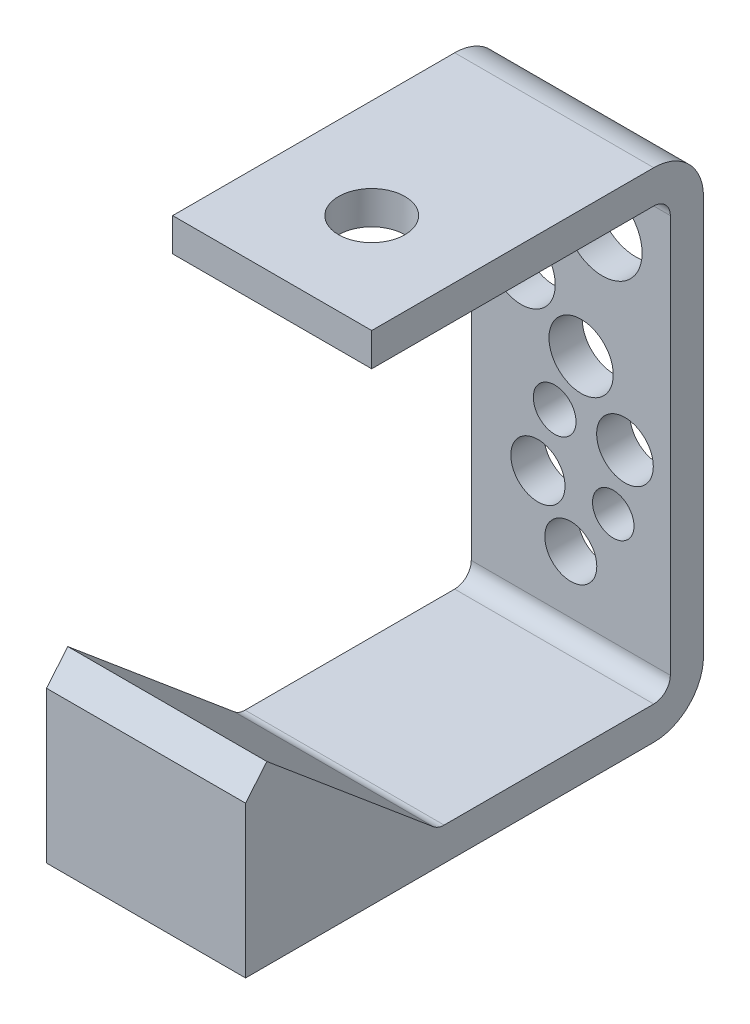
ISO-10303-21;
HEADER;
FILE_DESCRIPTION(('STEP AP214'),'2;1');
FILE_NAME('part.step','',(''),(''),'','','');
FILE_SCHEMA(('AUTOMOTIVE_DESIGN { 1 0 10303 214 1 1 1 1 }'));
ENDSEC;
DATA;
#1=APPLICATION_CONTEXT('core data for automotive mechanical design processes');
#2=APPLICATION_PROTOCOL_DEFINITION('international standard','automotive_design',2000,#1);
#3=PRODUCT_CONTEXT('',#1,'mechanical');
#4=PRODUCT('Part','Part','',(#3));
#5=PRODUCT_RELATED_PRODUCT_CATEGORY('part','',(#4));
#6=PRODUCT_DEFINITION_FORMATION('','',#4);
#7=PRODUCT_DEFINITION_CONTEXT('part definition',#1,'design');
#8=PRODUCT_DEFINITION('design','',#6,#7);
#9=PRODUCT_DEFINITION_SHAPE('','',#8);
#10=(LENGTH_UNIT() NAMED_UNIT(*) SI_UNIT(.MILLI.,.METRE.));
#11=(NAMED_UNIT(*) PLANE_ANGLE_UNIT() SI_UNIT($,.RADIAN.));
#12=(NAMED_UNIT(*) SI_UNIT($,.STERADIAN.) SOLID_ANGLE_UNIT());
#13=UNCERTAINTY_MEASURE_WITH_UNIT(LENGTH_MEASURE(1.E-05),#10,'distance_accuracy_value','');
#14=(GEOMETRIC_REPRESENTATION_CONTEXT(3) GLOBAL_UNCERTAINTY_ASSIGNED_CONTEXT((#13)) GLOBAL_UNIT_ASSIGNED_CONTEXT((#10,
#11,#12)) REPRESENTATION_CONTEXT('',''));
#15=CARTESIAN_POINT('',(0.,0.,0.));
#16=DIRECTION('',(0.,0.,1.));
#17=DIRECTION('',(1.,0.,0.));
#18=AXIS2_PLACEMENT_3D('',#15,#16,#17);
#19=CARTESIAN_POINT('',(19.05,88.9000000000004,3.17499999999983));
#20=DIRECTION('',(0.,-1.00000000000001,0.));
#21=DIRECTION('',(0.,0.,-1.00000000000001));
#22=AXIS2_PLACEMENT_3D('',#19,#20,#21);
#23=PLANE('',#22);
#24=CARTESIAN_POINT('',(0.,88.9000000000004,38.1000000000001));
#25=DIRECTION('',(0.,1.00000000000001,0.));
#26=DIRECTION('',(0.,0.,1.00000000000001));
#27=AXIS2_PLACEMENT_3D('',#24,#25,#26);
#28=CIRCLE('',#27,6.35);
#29=CARTESIAN_POINT('',(0.,88.9000000000004,44.4500000000002));
#30=VERTEX_POINT('',#29);
#31=EDGE_CURVE('E176',#30,#30,#28,.T.);
#32=ORIENTED_EDGE('',*,*,#31,.F.);
#33=EDGE_LOOP('',(#32));
#34=FACE_BOUND('',#33,.T.);
#35=DIRECTION('',(0.,0.,1.00000000000001));
#36=VECTOR('',#35,1.);
#37=CARTESIAN_POINT('',(-19.0500000000001,88.9000000000005,3.17499999999971));
#38=LINE('',#37,#36);
#39=CARTESIAN_POINT('',(-19.0500000000001,88.9000000000005,3.17499999999971));
#40=VERTEX_POINT('',#39);
#41=CARTESIAN_POINT('',(-19.05,88.9,57.15));
#42=VERTEX_POINT('',#41);
#43=EDGE_CURVE('E172',#40,#42,#38,.T.);
#44=ORIENTED_EDGE('',*,*,#43,.T.);
#45=DIRECTION('',(-1.,0.,0.));
#46=VECTOR('',#45,1.);
#47=CARTESIAN_POINT('',(19.0500000000001,88.9000000000005,57.1500000000003));
#48=LINE('',#47,#46);
#49=CARTESIAN_POINT('',(19.0500000000001,88.9000000000005,57.1500000000003));
#50=VERTEX_POINT('',#49);
#51=EDGE_CURVE('E11',#50,#42,#48,.T.);
#52=ORIENTED_EDGE('',*,*,#51,.F.);
#53=DIRECTION('',(0.,0.,1.00000000000001));
#54=VECTOR('',#53,1.);
#55=CARTESIAN_POINT('',(19.05,88.9000000000004,3.17499999999983));
#56=LINE('',#55,#54);
#57=CARTESIAN_POINT('',(19.05,88.9000000000004,3.17499999999983));
#58=VERTEX_POINT('',#57);
#59=EDGE_CURVE('E112',#58,#50,#56,.T.);
#60=ORIENTED_EDGE('',*,*,#59,.F.);
#61=DIRECTION('',(-1.,0.,0.));
#62=VECTOR('',#61,1.);
#63=CARTESIAN_POINT('',(19.05,88.9000000000004,3.17499999999983));
#64=LINE('',#63,#62);
#65=EDGE_CURVE('E168',#58,#40,#64,.T.);
#66=ORIENTED_EDGE('',*,*,#65,.T.);
#67=EDGE_LOOP('',(#44,#52,#60,#66));
#68=FACE_BOUND('',#67,.T.);
#69=ADVANCED_FACE('F37',(#34,#68),#23,.F.);
#70=CARTESIAN_POINT('',(19.0500000000001,82.5500000000004,57.1500000000003));
#71=DIRECTION('',(0.,0.,1.00000000000001));
#72=DIRECTION('',(1.,0.,0.));
#73=AXIS2_PLACEMENT_3D('',#70,#71,#72);
#74=PLANE('',#73);
#75=DIRECTION('',(0.,1.00000000000001,0.));
#76=VECTOR('',#75,1.);
#77=CARTESIAN_POINT('',(-19.05,82.5500000000005,57.1500000000003));
#78=LINE('',#77,#76);
#79=CARTESIAN_POINT('',(-19.05,82.5500000000005,57.1500000000003));
#80=VERTEX_POINT('',#79);
#81=EDGE_CURVE('E175',#80,#42,#78,.T.);
#82=ORIENTED_EDGE('',*,*,#81,.F.);
#83=DIRECTION('',(-1.,0.,0.));
#84=VECTOR('',#83,1.);
#85=CARTESIAN_POINT('',(19.0500000000001,82.5500000000004,57.1500000000003));
#86=LINE('',#85,#84);
#87=CARTESIAN_POINT('',(19.0500000000001,82.5500000000004,57.1500000000003));
#88=VERTEX_POINT('',#87);
#89=EDGE_CURVE('E45',#88,#80,#86,.T.);
#90=ORIENTED_EDGE('',*,*,#89,.F.);
#91=DIRECTION('',(0.,1.00000000000001,0.));
#92=VECTOR('',#91,1.);
#93=CARTESIAN_POINT('',(19.0500000000001,82.5500000000004,57.1500000000003));
#94=LINE('',#93,#92);
#95=EDGE_CURVE('E250',#88,#50,#94,.T.);
#96=ORIENTED_EDGE('',*,*,#95,.T.);
#97=ORIENTED_EDGE('',*,*,#51,.T.);
#98=EDGE_LOOP('',(#82,#90,#96,#97));
#99=FACE_BOUND('',#98,.T.);
#100=ADVANCED_FACE('F236',(#99),#74,.T.);
#101=CARTESIAN_POINT('',(19.0499999999999,82.5500000000002,3.17499999999989));
#102=DIRECTION('',(0.,-1.00000000000001,0.));
#103=DIRECTION('',(0.,0.,-1.00000000000001));
#104=AXIS2_PLACEMENT_3D('',#101,#102,#103);
#105=PLANE('',#104);
#106=CARTESIAN_POINT('',(0.,82.5500000000005,38.1000000000002));
#107=DIRECTION('',(0.,-1.00000000000001,0.));
#108=DIRECTION('',(0.,0.,-1.00000000000001));
#109=AXIS2_PLACEMENT_3D('',#106,#107,#108);
#110=CIRCLE('',#109,6.35);
#111=CARTESIAN_POINT('',(0.,82.5500000000005,31.7500000000002));
#112=VERTEX_POINT('',#111);
#113=EDGE_CURVE('E287',#112,#112,#110,.F.);
#114=ORIENTED_EDGE('',*,*,#113,.T.);
#115=EDGE_LOOP('',(#114));
#116=FACE_BOUND('',#115,.T.);
#117=DIRECTION('',(0.,0.,1.00000000000001));
#118=VECTOR('',#117,1.);
#119=CARTESIAN_POINT('',(-19.0500000000001,82.5500000000004,3.17499999999973));
#120=LINE('',#119,#118);
#121=CARTESIAN_POINT('',(-19.0500000000001,82.5500000000004,3.17499999999973));
#122=VERTEX_POINT('',#121);
#123=EDGE_CURVE('E179',#122,#80,#120,.T.);
#124=ORIENTED_EDGE('',*,*,#123,.F.);
#125=DIRECTION('',(-1.,0.,0.));
#126=VECTOR('',#125,1.);
#127=CARTESIAN_POINT('',(19.0499999999999,82.5500000000002,3.17499999999989));
#128=LINE('',#127,#126);
#129=CARTESIAN_POINT('',(19.0499999999999,82.5500000000002,3.17499999999989));
#130=VERTEX_POINT('',#129);
#131=EDGE_CURVE('E226',#130,#122,#128,.T.);
#132=ORIENTED_EDGE('',*,*,#131,.F.);
#133=DIRECTION('',(0.,0.,1.00000000000001));
#134=VECTOR('',#133,1.);
#135=CARTESIAN_POINT('',(19.0499999999999,82.5500000000002,3.17499999999989));
#136=LINE('',#135,#134);
#137=EDGE_CURVE('E233',#130,#88,#136,.T.);
#138=ORIENTED_EDGE('',*,*,#137,.T.);
#139=ORIENTED_EDGE('',*,*,#89,.T.);
#140=EDGE_LOOP('',(#124,#132,#138,#139));
#141=FACE_BOUND('',#140,.T.);
#142=ADVANCED_FACE('F231',(#116,#141),#105,.T.);
#143=CARTESIAN_POINT('',(19.05,79.3750000000003,3.17499999999979));
#144=DIRECTION('',(-1.,0.,0.));
#145=DIRECTION('',(0.,0.,1.00000000000001));
#146=AXIS2_PLACEMENT_3D('',#143,#144,#145);
#147=CYLINDRICAL_SURFACE('',#146,3.175);
#148=CARTESIAN_POINT('',(-19.0500000000001,79.3750000000004,3.17499999999968));
#149=DIRECTION('',(1.,0.,0.));
#150=DIRECTION('',(0.,0.,-1.00000000000001));
#151=AXIS2_PLACEMENT_3D('',#148,#149,#150);
#152=CIRCLE('',#151,3.175);
#153=CARTESIAN_POINT('',(-19.0500000000001,79.3750000000004,-2.91433543964104E-13));
#154=VERTEX_POINT('',#153);
#155=EDGE_CURVE('E182',#154,#122,#152,.T.);
#156=ORIENTED_EDGE('',*,*,#155,.F.);
#157=DIRECTION('',(-1.,0.,0.));
#158=VECTOR('',#157,1.);
#159=CARTESIAN_POINT('',(19.0499999999999,79.3750000000003,-2.08166817117217E-13));
#160=LINE('',#159,#158);
#161=CARTESIAN_POINT('',(19.0499999999999,79.3750000000003,-2.08166817117217E-13));
#162=VERTEX_POINT('',#161);
#163=EDGE_CURVE('E224',#162,#154,#160,.T.);
#164=ORIENTED_EDGE('',*,*,#163,.F.);
#165=CARTESIAN_POINT('',(19.05,79.3750000000003,3.17499999999979));
#166=DIRECTION('',(1.,0.,0.));
#167=DIRECTION('',(0.,0.,-1.00000000000001));
#168=AXIS2_PLACEMENT_3D('',#165,#166,#167);
#169=CIRCLE('',#168,3.175);
#170=EDGE_CURVE('E247',#162,#130,#169,.T.);
#171=ORIENTED_EDGE('',*,*,#170,.T.);
#172=ORIENTED_EDGE('',*,*,#131,.T.);
#173=EDGE_LOOP('',(#156,#164,#171,#172));
#174=FACE_BOUND('',#173,.T.);
#175=ADVANCED_FACE('F244',(#174),#147,.F.);
#176=CARTESIAN_POINT('',(19.05,3.175,0.));
#177=DIRECTION('',(0.,0.,1.00000000000001));
#178=DIRECTION('',(1.,0.,0.));
#179=AXIS2_PLACEMENT_3D('',#176,#177,#178);
#180=PLANE('',#179);
#181=CARTESIAN_POINT('',(10.3690662992588,36.1521874831047,0.));
#182=DIRECTION('',(0.,0.,1.00000000000001));
#183=DIRECTION('',(1.,0.,0.));
#184=AXIS2_PLACEMENT_3D('',#181,#182,#183);
#185=CIRCLE('',#184,5.42299269951171);
#186=CARTESIAN_POINT('',(15.7920589987705,36.1521874831047,0.));
#187=VERTEX_POINT('',#186);
#188=EDGE_CURVE('E351',#187,#187,#185,.F.);
#189=ORIENTED_EDGE('',*,*,#188,.T.);
#190=EDGE_LOOP('',(#189));
#191=FACE_BOUND('',#190,.T.);
#192=CARTESIAN_POINT('',(0.,14.1796422299133,0.));
#193=DIRECTION('',(0.,0.,1.00000000000001));
#194=DIRECTION('',(1.,0.,0.));
#195=AXIS2_PLACEMENT_3D('',#192,#193,#194);
#196=CIRCLE('',#195,4.97607649487025);
#197=CARTESIAN_POINT('',(4.97607649487025,14.1796422299133,0.));
#198=VERTEX_POINT('',#197);
#199=EDGE_CURVE('E347',#198,#198,#196,.F.);
#200=ORIENTED_EDGE('',*,*,#199,.T.);
#201=EDGE_LOOP('',(#200));
#202=FACE_BOUND('',#201,.T.);
#203=CARTESIAN_POINT('',(-6.29550453883584,24.4252672637048,0.));
#204=DIRECTION('',(0.,0.,1.00000000000001));
#205=DIRECTION('',(1.,0.,0.));
#206=AXIS2_PLACEMENT_3D('',#203,#204,#205);
#207=CIRCLE('',#206,5.18600248029509);
#208=CARTESIAN_POINT('',(-1.10950205854076,24.4252672637048,0.));
#209=VERTEX_POINT('',#208);
#210=EDGE_CURVE('E341',#209,#209,#207,.F.);
#211=ORIENTED_EDGE('',*,*,#210,.T.);
#212=EDGE_LOOP('',(#211));
#213=FACE_BOUND('',#212,.T.);
#214=CARTESIAN_POINT('',(8.12486395345894,24.4252672637048,0.));
#215=DIRECTION('',(0.,0.,1.00000000000001));
#216=DIRECTION('',(1.,0.,0.));
#217=AXIS2_PLACEMENT_3D('',#214,#215,#216);
#218=CIRCLE('',#217,3.96599232547309);
#219=CARTESIAN_POINT('',(12.090856278932,24.4252672637048,0.));
#220=VERTEX_POINT('',#219);
#221=EDGE_CURVE('E335',#220,#220,#218,.F.);
#222=ORIENTED_EDGE('',*,*,#221,.T.);
#223=EDGE_LOOP('',(#222));
#224=FACE_BOUND('',#223,.T.);
#225=CARTESIAN_POINT('',(-3.08603163668428,36.1521874831047,0.));
#226=DIRECTION('',(0.,0.,1.00000000000001));
#227=DIRECTION('',(1.,0.,0.));
#228=AXIS2_PLACEMENT_3D('',#225,#226,#227);
#229=CIRCLE('',#228,4.08663304422149);
#230=CARTESIAN_POINT('',(1.00060140753721,36.1521874831047,0.));
#231=VERTEX_POINT('',#230);
#232=EDGE_CURVE('E327',#231,#231,#229,.F.);
#233=ORIENTED_EDGE('',*,*,#232,.T.);
#234=EDGE_LOOP('',(#233));
#235=FACE_BOUND('',#234,.T.);
#236=CARTESIAN_POINT('',(-9.50497744098741,56.8903200816225,0.));
#237=DIRECTION('',(0.,0.,1.00000000000001));
#238=DIRECTION('',(1.,0.,0.));
#239=AXIS2_PLACEMENT_3D('',#236,#237,#238);
#240=CIRCLE('',#239,6.52839763023499);
#241=CARTESIAN_POINT('',(-2.97657981075242,56.8903200816225,0.));
#242=VERTEX_POINT('',#241);
#243=EDGE_CURVE('E321',#242,#242,#240,.F.);
#244=ORIENTED_EDGE('',*,*,#243,.T.);
#245=EDGE_LOOP('',(#244));
#246=FACE_BOUND('',#245,.T.);
#247=CARTESIAN_POINT('',(1.97506024747779,47.5087839061026,0.));
#248=DIRECTION('',(0.,0.,1.00000000000001));
#249=DIRECTION('',(1.,0.,0.));
#250=AXIS2_PLACEMENT_3D('',#247,#248,#249);
#251=CIRCLE('',#250,6.14980370598115);
#252=CARTESIAN_POINT('',(8.12486395345894,47.5087839061026,0.));
#253=VERTEX_POINT('',#252);
#254=EDGE_CURVE('E315',#253,#253,#251,.F.);
#255=ORIENTED_EDGE('',*,*,#254,.T.);
#256=EDGE_LOOP('',(#255));
#257=FACE_BOUND('',#256,.T.);
#258=CARTESIAN_POINT('',(6.04862200790092,70.4688592830329,0.));
#259=DIRECTION('',(0.,0.,1.00000000000001));
#260=DIRECTION('',(1.,0.,0.));
#261=AXIS2_PLACEMENT_3D('',#258,#259,#260);
#262=CIRCLE('',#261,7.60241873712323);
#263=CARTESIAN_POINT('',(13.6510407450241,70.4688592830329,0.));
#264=VERTEX_POINT('',#263);
#265=EDGE_CURVE('E308',#264,#264,#262,.F.);
#266=ORIENTED_EDGE('',*,*,#265,.T.);
#267=EDGE_LOOP('',(#266));
#268=FACE_BOUND('',#267,.T.);
#269=DIRECTION('',(0.,1.00000000000001,0.));
#270=VECTOR('',#269,1.);
#271=CARTESIAN_POINT('',(-19.05,3.17500000000002,0.));
#272=LINE('',#271,#270);
#273=CARTESIAN_POINT('',(-19.05,3.17500000000002,0.));
#274=VERTEX_POINT('',#273);
#275=EDGE_CURVE('E185',#274,#154,#272,.T.);
#276=ORIENTED_EDGE('',*,*,#275,.F.);
#277=DIRECTION('',(-1.,0.,0.));
#278=VECTOR('',#277,1.);
#279=CARTESIAN_POINT('',(19.05,3.175,0.));
#280=LINE('',#279,#278);
#281=CARTESIAN_POINT('',(19.05,3.175,0.));
#282=VERTEX_POINT('',#281);
#283=EDGE_CURVE('E222',#282,#274,#280,.T.);
#284=ORIENTED_EDGE('',*,*,#283,.F.);
#285=DIRECTION('',(0.,1.00000000000001,0.));
#286=VECTOR('',#285,1.);
#287=CARTESIAN_POINT('',(19.05,3.175,0.));
#288=LINE('',#287,#286);
#289=EDGE_CURVE('E252',#282,#162,#288,.T.);
#290=ORIENTED_EDGE('',*,*,#289,.T.);
#291=ORIENTED_EDGE('',*,*,#163,.T.);
#292=EDGE_LOOP('',(#276,#284,#290,#291));
#293=FACE_BOUND('',#292,.T.);
#294=ADVANCED_FACE('F426',(#191,#202,#213,#224,#235,#246,#257,#268,#293),#180,.T.);
#295=CARTESIAN_POINT('',(19.05,3.17499999999997,3.17499999999997));
#296=DIRECTION('',(-1.,0.,0.));
#297=DIRECTION('',(0.,0.,1.00000000000001));
#298=AXIS2_PLACEMENT_3D('',#295,#296,#297);
#299=CYLINDRICAL_SURFACE('',#298,3.175);
#300=CARTESIAN_POINT('',(-19.05,3.17499999999999,3.175));
#301=DIRECTION('',(1.,0.,0.));
#302=DIRECTION('',(0.,0.,1.00000000000001));
#303=AXIS2_PLACEMENT_3D('',#300,#301,#302);
#304=CIRCLE('',#303,3.175);
#305=CARTESIAN_POINT('',(-19.05,0.,3.17499999999998));
#306=VERTEX_POINT('',#305);
#307=EDGE_CURVE('E188',#306,#274,#304,.T.);
#308=ORIENTED_EDGE('',*,*,#307,.F.);
#309=DIRECTION('',(-1.,0.,0.));
#310=VECTOR('',#309,1.);
#311=CARTESIAN_POINT('',(19.05,0.,3.17499999999998));
#312=LINE('',#311,#310);
#313=CARTESIAN_POINT('',(19.05,0.,3.17499999999998));
#314=VERTEX_POINT('',#313);
#315=EDGE_CURVE('E220',#314,#306,#312,.T.);
#316=ORIENTED_EDGE('',*,*,#315,.F.);
#317=CARTESIAN_POINT('',(19.05,3.17499999999997,3.17499999999997));
#318=DIRECTION('',(1.,0.,0.));
#319=DIRECTION('',(0.,0.,1.00000000000001));
#320=AXIS2_PLACEMENT_3D('',#317,#318,#319);
#321=CIRCLE('',#320,3.175);
#322=EDGE_CURVE('E258',#314,#282,#321,.T.);
#323=ORIENTED_EDGE('',*,*,#322,.T.);
#324=ORIENTED_EDGE('',*,*,#283,.T.);
#325=EDGE_LOOP('',(#308,#316,#323,#324));
#326=FACE_BOUND('',#325,.T.);
#327=ADVANCED_FACE('F422',(#326),#299,.F.);
#328=CARTESIAN_POINT('',(19.0500000000001,0.,43.2943945062051));
#329=DIRECTION('',(0.,1.00000000000001,0.));
#330=DIRECTION('',(0.,0.,1.00000000000001));
#331=AXIS2_PLACEMENT_3D('',#328,#329,#330);
#332=PLANE('',#331);
#333=DIRECTION('',(0.,0.,-1.00000000000001));
#334=VECTOR('',#333,1.);
#335=CARTESIAN_POINT('',(-19.0499999999999,0.,43.294394506205));
#336=LINE('',#335,#334);
#337=CARTESIAN_POINT('',(-19.0499999999999,0.,43.294394506205));
#338=VERTEX_POINT('',#337);
#339=EDGE_CURVE('E191',#338,#306,#336,.T.);
#340=ORIENTED_EDGE('',*,*,#339,.F.);
#341=DIRECTION('',(-1.,0.,0.));
#342=VECTOR('',#341,1.);
#343=CARTESIAN_POINT('',(19.0500000000001,0.,43.2943945062051));
#344=LINE('',#343,#342);
#345=CARTESIAN_POINT('',(19.0500000000001,0.,43.2943945062051));
#346=VERTEX_POINT('',#345);
#347=EDGE_CURVE('E218',#346,#338,#344,.T.);
#348=ORIENTED_EDGE('',*,*,#347,.F.);
#349=DIRECTION('',(0.,0.,-1.00000000000001));
#350=VECTOR('',#349,1.);
#351=CARTESIAN_POINT('',(19.0500000000001,0.,43.2943945062051));
#352=LINE('',#351,#350);
#353=EDGE_CURVE('E261',#346,#314,#352,.T.);
#354=ORIENTED_EDGE('',*,*,#353,.T.);
#355=ORIENTED_EDGE('',*,*,#315,.T.);
#356=EDGE_LOOP('',(#340,#348,#354,#355));
#357=FACE_BOUND('',#356,.T.);
#358=ADVANCED_FACE('F418',(#357),#332,.T.);
#359=CARTESIAN_POINT('',(19.0500000000001,3.17499999999996,43.2943945062051));
#360=DIRECTION('',(-1.,0.,0.));
#361=DIRECTION('',(0.,0.,1.00000000000001));
#362=AXIS2_PLACEMENT_3D('',#359,#360,#361);
#363=CYLINDRICAL_SURFACE('',#362,3.175);
#364=CARTESIAN_POINT('',(-19.0499999999999,3.17499999999997,43.294394506205));
#365=DIRECTION('',(1.,0.,0.));
#366=DIRECTION('',(0.,0.,-1.00000000000001));
#367=AXIS2_PLACEMENT_3D('',#364,#365,#366);
#368=CIRCLE('',#367,3.175);
#369=CARTESIAN_POINT('',(-19.0499999999999,0.742808893097198,45.3352451669598));
#370=VERTEX_POINT('',#369);
#371=EDGE_CURVE('E194',#370,#338,#368,.T.);
#372=ORIENTED_EDGE('',*,*,#371,.F.);
#373=DIRECTION('',(-1.,0.,0.));
#374=VECTOR('',#373,1.);
#375=CARTESIAN_POINT('',(19.0500000000002,0.742808893097191,45.3352451669599));
#376=LINE('',#375,#374);
#377=CARTESIAN_POINT('',(19.0500000000002,0.742808893097191,45.3352451669599));
#378=VERTEX_POINT('',#377);
#379=EDGE_CURVE('E216',#378,#370,#376,.T.);
#380=ORIENTED_EDGE('',*,*,#379,.F.);
#381=CARTESIAN_POINT('',(19.0500000000001,3.17499999999996,43.2943945062051));
#382=DIRECTION('',(1.,0.,0.));
#383=DIRECTION('',(0.,0.,-1.00000000000001));
#384=AXIS2_PLACEMENT_3D('',#381,#382,#383);
#385=CIRCLE('',#384,3.175);
#386=EDGE_CURVE('E264',#378,#346,#385,.T.);
#387=ORIENTED_EDGE('',*,*,#386,.T.);
#388=ORIENTED_EDGE('',*,*,#347,.T.);
#389=EDGE_LOOP('',(#372,#380,#387,#388));
#390=FACE_BOUND('',#389,.T.);
#391=ADVANCED_FACE('F414',(#390),#363,.F.);
#392=CARTESIAN_POINT('',(19.0500000000002,27.4943401016882,77.2164785921944));
#393=DIRECTION('',(0.,0.766044443118981,-0.642787609686547));
#394=DIRECTION('',(0.,0.642787609686543,0.766044443118984));
#395=AXIS2_PLACEMENT_3D('',#392,#393,#394);
#396=PLANE('',#395);
#397=DIRECTION('',(0.,-0.642787609686543,-0.766044443118984));
#398=VECTOR('',#397,1.);
#399=CARTESIAN_POINT('',(-19.0499999999999,27.4943401016882,77.2164785921944));
#400=LINE('',#399,#398);
#401=CARTESIAN_POINT('',(-19.0499999999999,27.4943401016882,77.2164785921944));
#402=VERTEX_POINT('',#401);
#403=EDGE_CURVE('E197',#402,#370,#400,.T.);
#404=ORIENTED_EDGE('',*,*,#403,.F.);
#405=DIRECTION('',(-1.,0.,0.));
#406=VECTOR('',#405,1.);
#407=CARTESIAN_POINT('',(19.0500000000002,27.4943401016882,77.2164785921944));
#408=LINE('',#407,#406);
#409=CARTESIAN_POINT('',(19.0500000000002,27.4943401016882,77.2164785921944));
#410=VERTEX_POINT('',#409);
#411=EDGE_CURVE('E214',#410,#402,#408,.T.);
#412=ORIENTED_EDGE('',*,*,#411,.F.);
#413=DIRECTION('',(0.,-0.642787609686543,-0.766044443118984));
#414=VECTOR('',#413,1.);
#415=CARTESIAN_POINT('',(19.0500000000002,27.4943401016882,77.2164785921944));
#416=LINE('',#415,#414);
#417=EDGE_CURVE('E267',#410,#378,#416,.T.);
#418=ORIENTED_EDGE('',*,*,#417,.T.);
#419=ORIENTED_EDGE('',*,*,#379,.T.);
#420=EDGE_LOOP('',(#404,#412,#418,#419));
#421=FACE_BOUND('',#420,.T.);
#422=ADVANCED_FACE('F411',(#421),#396,.T.);
#423=CARTESIAN_POINT('',(19.0500000000002,22.6299578878827,81.2981799137041));
#424=DIRECTION('',(0.,0.642787609686543,0.766044443118983));
#425=DIRECTION('',(0.,-0.766044443118981,0.642787609686548));
#426=AXIS2_PLACEMENT_3D('',#423,#424,#425);
#427=PLANE('',#426);
#428=DIRECTION('',(0.,0.766044443118981,-0.642787609686548));
#429=VECTOR('',#428,1.);
#430=CARTESIAN_POINT('',(-19.0499999999999,22.6299578878827,81.298179913704));
#431=LINE('',#430,#429);
#432=CARTESIAN_POINT('',(-19.0499999999999,22.6299578878827,81.298179913704));
#433=VERTEX_POINT('',#432);
#434=EDGE_CURVE('E200',#433,#402,#431,.T.);
#435=ORIENTED_EDGE('',*,*,#434,.F.);
#436=DIRECTION('',(-1.,0.,0.));
#437=VECTOR('',#436,1.);
#438=CARTESIAN_POINT('',(19.0500000000002,22.6299578878827,81.2981799137041));
#439=LINE('',#438,#437);
#440=CARTESIAN_POINT('',(19.0500000000002,22.6299578878827,81.2981799137041));
#441=VERTEX_POINT('',#440);
#442=EDGE_CURVE('E211',#441,#433,#439,.T.);
#443=ORIENTED_EDGE('',*,*,#442,.F.);
#444=DIRECTION('',(0.,0.766044443118981,-0.642787609686548));
#445=VECTOR('',#444,1.);
#446=CARTESIAN_POINT('',(19.0500000000002,22.6299578878827,81.2981799137041));
#447=LINE('',#446,#445);
#448=EDGE_CURVE('E270',#441,#410,#447,.T.);
#449=ORIENTED_EDGE('',*,*,#448,.T.);
#450=ORIENTED_EDGE('',*,*,#411,.T.);
#451=EDGE_LOOP('',(#435,#443,#449,#450));
#452=FACE_BOUND('',#451,.T.);
#453=ADVANCED_FACE('F274',(#452),#427,.T.);
#454=CARTESIAN_POINT('',(19.0500000000001,-6.35000000000009,43.2943945062051));
#455=DIRECTION('',(0.,1.00000000000001,0.));
#456=DIRECTION('',(0.,0.,1.00000000000001));
#457=AXIS2_PLACEMENT_3D('',#454,#455,#456);
#458=PLANE('',#457);
#459=DIRECTION('',(0.,0.,-1.00000000000001));
#460=VECTOR('',#459,1.);
#461=CARTESIAN_POINT('',(-19.05,-6.35000000000008,43.294394506205));
#462=LINE('',#461,#460);
#463=CARTESIAN_POINT('',(-19.0500000000002,-6.35000000000009,81.2981799137041));
#464=VERTEX_POINT('',#463);
#465=CARTESIAN_POINT('',(-19.05,-6.35,3.17499999999997));
#466=VERTEX_POINT('',#465);
#467=EDGE_CURVE('E203',#464,#466,#462,.T.);
#468=ORIENTED_EDGE('',*,*,#467,.T.);
#469=DIRECTION('',(-1.,0.,0.));
#470=VECTOR('',#469,1.);
#471=CARTESIAN_POINT('',(19.05,-6.35,3.175));
#472=LINE('',#471,#470);
#473=CARTESIAN_POINT('',(19.05,-6.35,3.175));
#474=VERTEX_POINT('',#473);
#475=EDGE_CURVE('E163',#474,#466,#472,.T.);
#476=ORIENTED_EDGE('',*,*,#475,.F.);
#477=DIRECTION('',(0.,0.,-1.00000000000001));
#478=VECTOR('',#477,1.);
#479=CARTESIAN_POINT('',(19.0500000000001,-6.35000000000009,43.2943945062051));
#480=LINE('',#479,#478);
#481=CARTESIAN_POINT('',(19.0499999999998,-6.35000000000009,81.2981799137041));
#482=VERTEX_POINT('',#481);
#483=EDGE_CURVE('E154',#482,#474,#480,.T.);
#484=ORIENTED_EDGE('',*,*,#483,.F.);
#485=DIRECTION('',(-1.,0.,0.));
#486=VECTOR('',#485,1.);
#487=CARTESIAN_POINT('',(66.8425272870422,-6.35000000000009,81.2981799137041));
#488=LINE('',#487,#486);
#489=EDGE_CURVE('E286',#482,#464,#488,.T.);
#490=ORIENTED_EDGE('',*,*,#489,.T.);
#491=EDGE_LOOP('',(#468,#476,#484,#490));
#492=FACE_BOUND('',#491,.T.);
#493=ADVANCED_FACE('F305',(#492),#458,.F.);
#494=CARTESIAN_POINT('',(19.05,3.17499999999997,3.17499999999997));
#495=DIRECTION('',(-1.,0.,0.));
#496=DIRECTION('',(0.,0.,1.00000000000001));
#497=AXIS2_PLACEMENT_3D('',#494,#495,#496);
#498=CYLINDRICAL_SURFACE('',#497,9.525);
#499=CARTESIAN_POINT('',(-19.05,3.17499999999999,3.175));
#500=DIRECTION('',(1.,0.,0.));
#501=DIRECTION('',(0.,0.,-1.00000000000001));
#502=AXIS2_PLACEMENT_3D('',#499,#500,#501);
#503=CIRCLE('',#502,9.525);
#504=CARTESIAN_POINT('',(-19.0500000000001,3.17500000000001,-6.35000000000015));
#505=VERTEX_POINT('',#504);
#506=EDGE_CURVE('E162',#466,#505,#503,.T.);
#507=ORIENTED_EDGE('',*,*,#506,.T.);
#508=DIRECTION('',(-1.,0.,0.));
#509=VECTOR('',#508,1.);
#510=CARTESIAN_POINT('',(19.05,3.17499999999999,-6.35000000000001));
#511=LINE('',#510,#509);
#512=CARTESIAN_POINT('',(19.05,3.17499999999999,-6.35000000000001));
#513=VERTEX_POINT('',#512);
#514=EDGE_CURVE('E159',#513,#505,#511,.T.);
#515=ORIENTED_EDGE('',*,*,#514,.F.);
#516=CARTESIAN_POINT('',(19.05,3.17499999999997,3.17499999999997));
#517=DIRECTION('',(1.,0.,0.));
#518=DIRECTION('',(0.,0.,-1.00000000000001));
#519=AXIS2_PLACEMENT_3D('',#516,#517,#518);
#520=CIRCLE('',#519,9.525);
#521=EDGE_CURVE('E147',#474,#513,#520,.T.);
#522=ORIENTED_EDGE('',*,*,#521,.F.);
#523=ORIENTED_EDGE('',*,*,#475,.T.);
#524=EDGE_LOOP('',(#507,#515,#522,#523));
#525=FACE_BOUND('',#524,.T.);
#526=ADVANCED_FACE('F160',(#525),#498,.T.);
#527=CARTESIAN_POINT('',(19.05,3.17499999999999,-6.35000000000001));
#528=DIRECTION('',(0.,0.,1.00000000000001));
#529=DIRECTION('',(1.,0.,0.));
#530=AXIS2_PLACEMENT_3D('',#527,#528,#529);
#531=PLANE('',#530);
#532=CARTESIAN_POINT('',(10.3690662992588,36.1521874831047,-6.34999999999995));
#533=DIRECTION('',(0.,0.,-1.));
#534=DIRECTION('',(-1.,0.,0.));
#535=AXIS2_PLACEMENT_3D('',#532,#533,#534);
#536=CIRCLE('',#535,5.42299269951171);
#537=CARTESIAN_POINT('',(4.94607359974707,36.1521874831047,-6.34999999999994));
#538=VERTEX_POINT('',#537);
#539=EDGE_CURVE('E350',#538,#538,#536,.T.);
#540=ORIENTED_EDGE('',*,*,#539,.F.);
#541=EDGE_LOOP('',(#540));
#542=FACE_BOUND('',#541,.T.);
#543=CARTESIAN_POINT('',(0.,14.1796422299133,-6.34999999999995));
#544=DIRECTION('',(0.,0.,-1.));
#545=DIRECTION('',(-1.,0.,0.));
#546=AXIS2_PLACEMENT_3D('',#543,#544,#545);
#547=CIRCLE('',#546,4.97607649487025);
#548=CARTESIAN_POINT('',(-4.97607649487027,14.1796422299133,-6.34999999999994));
#549=VERTEX_POINT('',#548);
#550=EDGE_CURVE('E344',#549,#549,#547,.T.);
#551=ORIENTED_EDGE('',*,*,#550,.F.);
#552=EDGE_LOOP('',(#551));
#553=FACE_BOUND('',#552,.T.);
#554=CARTESIAN_POINT('',(-6.29550453883586,24.4252672637048,-6.34999999999992));
#555=DIRECTION('',(0.,0.,-1.));
#556=DIRECTION('',(-1.,0.,0.));
#557=AXIS2_PLACEMENT_3D('',#554,#555,#556);
#558=CIRCLE('',#557,5.18600248029509);
#559=CARTESIAN_POINT('',(-11.4815070191309,24.4252672637048,-6.34999999999991));
#560=VERTEX_POINT('',#559);
#561=EDGE_CURVE('E338',#560,#560,#558,.T.);
#562=ORIENTED_EDGE('',*,*,#561,.F.);
#563=EDGE_LOOP('',(#562));
#564=FACE_BOUND('',#563,.T.);
#565=CARTESIAN_POINT('',(8.12486395345893,24.4252672637048,-6.34999999999996));
#566=DIRECTION('',(0.,0.,-1.));
#567=DIRECTION('',(-1.,0.,0.));
#568=AXIS2_PLACEMENT_3D('',#565,#566,#567);
#569=CIRCLE('',#568,3.96599232547309);
#570=CARTESIAN_POINT('',(4.15887162798583,24.4252672637048,-6.34999999999995));
#571=VERTEX_POINT('',#570);
#572=EDGE_CURVE('E330',#571,#571,#569,.T.);
#573=ORIENTED_EDGE('',*,*,#572,.F.);
#574=EDGE_LOOP('',(#573));
#575=FACE_BOUND('',#574,.T.);
#576=CARTESIAN_POINT('',(-3.08603163668429,36.1521874831047,-6.34999999999992));
#577=DIRECTION('',(0.,0.,-1.));
#578=DIRECTION('',(-1.,0.,0.));
#579=AXIS2_PLACEMENT_3D('',#576,#577,#578);
#580=CIRCLE('',#579,4.08663304422149);
#581=CARTESIAN_POINT('',(-7.17266468090578,36.1521874831047,-6.34999999999991));
#582=VERTEX_POINT('',#581);
#583=EDGE_CURVE('E324',#582,#582,#580,.T.);
#584=ORIENTED_EDGE('',*,*,#583,.F.);
#585=EDGE_LOOP('',(#584));
#586=FACE_BOUND('',#585,.T.);
#587=CARTESIAN_POINT('',(-9.50497744098743,56.8903200816225,-6.34999999999988));
#588=DIRECTION('',(0.,0.,-1.));
#589=DIRECTION('',(-1.,0.,0.));
#590=AXIS2_PLACEMENT_3D('',#587,#588,#589);
#591=CIRCLE('',#590,6.52839763023499);
#592=CARTESIAN_POINT('',(-16.0333750712224,56.8903200816225,-6.34999999999987));
#593=VERTEX_POINT('',#592);
#594=EDGE_CURVE('E318',#593,#593,#591,.T.);
#595=ORIENTED_EDGE('',*,*,#594,.F.);
#596=EDGE_LOOP('',(#595));
#597=FACE_BOUND('',#596,.T.);
#598=CARTESIAN_POINT('',(1.97506024747777,47.5087839061026,-6.34999999999992));
#599=DIRECTION('',(0.,0.,-1.));
#600=DIRECTION('',(-1.,0.,0.));
#601=AXIS2_PLACEMENT_3D('',#598,#599,#600);
#602=CIRCLE('',#601,6.14980370598115);
#603=CARTESIAN_POINT('',(-4.17474345850338,47.5087839061026,-6.34999999999991));
#604=VERTEX_POINT('',#603);
#605=EDGE_CURVE('E313',#604,#604,#602,.T.);
#606=ORIENTED_EDGE('',*,*,#605,.F.);
#607=EDGE_LOOP('',(#606));
#608=FACE_BOUND('',#607,.T.);
#609=CARTESIAN_POINT('',(6.0486220079009,70.4688592830329,-6.34999999999991));
#610=DIRECTION('',(0.,0.,-1.));
#611=DIRECTION('',(-1.,0.,0.));
#612=AXIS2_PLACEMENT_3D('',#609,#610,#611);
#613=CIRCLE('',#612,7.60241873712323);
#614=CARTESIAN_POINT('',(-1.55379672922232,70.4688592830329,-6.34999999999989));
#615=VERTEX_POINT('',#614);
#616=EDGE_CURVE('E306',#615,#615,#613,.T.);
#617=ORIENTED_EDGE('',*,*,#616,.F.);
#618=EDGE_LOOP('',(#617));
#619=FACE_BOUND('',#618,.T.);
#620=DIRECTION('',(0.,1.00000000000001,0.));
#621=VECTOR('',#620,1.);
#622=CARTESIAN_POINT('',(-19.0500000000001,3.17500000000001,-6.35000000000015));
#623=LINE('',#622,#621);
#624=CARTESIAN_POINT('',(-19.0500000000002,79.3750000000004,-6.35000000000034));
#625=VERTEX_POINT('',#624);
#626=EDGE_CURVE('E100',#505,#625,#623,.T.);
#627=ORIENTED_EDGE('',*,*,#626,.T.);
#628=DIRECTION('',(-1.,0.,0.));
#629=VECTOR('',#628,1.);
#630=CARTESIAN_POINT('',(19.0499999999999,79.3750000000004,-6.35000000000023));
#631=LINE('',#630,#629);
#632=CARTESIAN_POINT('',(19.0499999999999,79.3750000000004,-6.35000000000023));
#633=VERTEX_POINT('',#632);
#634=EDGE_CURVE('E164',#633,#625,#631,.T.);
#635=ORIENTED_EDGE('',*,*,#634,.F.);
#636=DIRECTION('',(0.,1.00000000000001,0.));
#637=VECTOR('',#636,1.);
#638=CARTESIAN_POINT('',(19.05,3.17499999999999,-6.35000000000001));
#639=LINE('',#638,#637);
#640=EDGE_CURVE('E152',#513,#633,#639,.T.);
#641=ORIENTED_EDGE('',*,*,#640,.F.);
#642=ORIENTED_EDGE('',*,*,#514,.T.);
#643=EDGE_LOOP('',(#627,#635,#641,#642));
#644=FACE_BOUND('',#643,.T.);
#645=ADVANCED_FACE('F166',(#542,#553,#564,#575,#586,#597,#608,#619,#644),#531,.F.);
#646=CARTESIAN_POINT('',(19.05,79.3750000000003,3.17499999999979));
#647=DIRECTION('',(-1.,0.,0.));
#648=DIRECTION('',(0.,0.,1.00000000000001));
#649=AXIS2_PLACEMENT_3D('',#646,#647,#648);
#650=CYLINDRICAL_SURFACE('',#649,9.525);
#651=CARTESIAN_POINT('',(-19.0500000000001,79.3750000000004,3.17499999999968));
#652=DIRECTION('',(1.,0.,0.));
#653=DIRECTION('',(0.,0.,-1.00000000000001));
#654=AXIS2_PLACEMENT_3D('',#651,#652,#653);
#655=CIRCLE('',#654,9.525);
#656=EDGE_CURVE('E106',#625,#40,#655,.T.);
#657=ORIENTED_EDGE('',*,*,#656,.T.);
#658=ORIENTED_EDGE('',*,*,#65,.F.);
#659=CARTESIAN_POINT('',(19.05,79.3750000000003,3.17499999999979));
#660=DIRECTION('',(1.,0.,0.));
#661=DIRECTION('',(0.,0.,-1.00000000000001));
#662=AXIS2_PLACEMENT_3D('',#659,#660,#661);
#663=CIRCLE('',#662,9.525);
#664=EDGE_CURVE('E53',#633,#58,#663,.T.);
#665=ORIENTED_EDGE('',*,*,#664,.F.);
#666=ORIENTED_EDGE('',*,*,#634,.T.);
#667=EDGE_LOOP('',(#657,#658,#665,#666));
#668=FACE_BOUND('',#667,.T.);
#669=ADVANCED_FACE('F361',(#668),#650,.T.);
#670=CARTESIAN_POINT('',(19.05,79.3750000000003,3.17499999999979));
#671=DIRECTION('',(1.,0.,0.));
#672=DIRECTION('',(0.,0.,-1.00000000000001));
#673=AXIS2_PLACEMENT_3D('',#670,#671,#672);
#674=PLANE('',#673);
#675=DIRECTION('',(0.,-1.,0.));
#676=VECTOR('',#675,1.);
#677=CARTESIAN_POINT('',(19.0499999999997,0.,81.2981799137041));
#678=LINE('',#677,#676);
#679=EDGE_CURVE('E278',#441,#482,#678,.T.);
#680=ORIENTED_EDGE('',*,*,#679,.T.);
#681=ORIENTED_EDGE('',*,*,#483,.T.);
#682=ORIENTED_EDGE('',*,*,#521,.T.);
#683=ORIENTED_EDGE('',*,*,#640,.T.);
#684=ORIENTED_EDGE('',*,*,#664,.T.);
#685=ORIENTED_EDGE('',*,*,#59,.T.);
#686=ORIENTED_EDGE('',*,*,#95,.F.);
#687=ORIENTED_EDGE('',*,*,#137,.F.);
#688=ORIENTED_EDGE('',*,*,#170,.F.);
#689=ORIENTED_EDGE('',*,*,#289,.F.);
#690=ORIENTED_EDGE('',*,*,#322,.F.);
#691=ORIENTED_EDGE('',*,*,#353,.F.);
#692=ORIENTED_EDGE('',*,*,#386,.F.);
#693=ORIENTED_EDGE('',*,*,#417,.F.);
#694=ORIENTED_EDGE('',*,*,#448,.F.);
#695=EDGE_LOOP('',(#680,#681,#682,#683,#684,#685,#686,#687,#688,#689,#690,#691,#692,#693,#694));
#696=FACE_BOUND('',#695,.T.);
#697=ADVANCED_FACE('F150',(#696),#674,.T.);
#698=CARTESIAN_POINT('',(-19.0500000000001,79.3750000000004,3.17499999999968));
#699=DIRECTION('',(1.,0.,0.));
#700=DIRECTION('',(0.,0.,-1.00000000000001));
#701=AXIS2_PLACEMENT_3D('',#698,#699,#700);
#702=PLANE('',#701);
#703=ORIENTED_EDGE('',*,*,#467,.F.);
#704=DIRECTION('',(0.,-1.,0.));
#705=VECTOR('',#704,1.);
#706=CARTESIAN_POINT('',(-19.0500000000002,0.,81.2981799137041));
#707=LINE('',#706,#705);
#708=EDGE_CURVE('E291',#433,#464,#707,.T.);
#709=ORIENTED_EDGE('',*,*,#708,.F.);
#710=ORIENTED_EDGE('',*,*,#434,.T.);
#711=ORIENTED_EDGE('',*,*,#403,.T.);
#712=ORIENTED_EDGE('',*,*,#371,.T.);
#713=ORIENTED_EDGE('',*,*,#339,.T.);
#714=ORIENTED_EDGE('',*,*,#307,.T.);
#715=ORIENTED_EDGE('',*,*,#275,.T.);
#716=ORIENTED_EDGE('',*,*,#155,.T.);
#717=ORIENTED_EDGE('',*,*,#123,.T.);
#718=ORIENTED_EDGE('',*,*,#81,.T.);
#719=ORIENTED_EDGE('',*,*,#43,.F.);
#720=ORIENTED_EDGE('',*,*,#656,.F.);
#721=ORIENTED_EDGE('',*,*,#626,.F.);
#722=ORIENTED_EDGE('',*,*,#506,.F.);
#723=EDGE_LOOP('',(#703,#709,#710,#711,#712,#713,#714,#715,#716,#717,#718,#719,#720,#721,#722));
#724=FACE_BOUND('',#723,.T.);
#725=ADVANCED_FACE('F240',(#724),#702,.F.);
#726=CARTESIAN_POINT('',(0.,-6.3510000000001,38.1000000000003));
#727=DIRECTION('',(0.,1.00000000000001,0.));
#728=DIRECTION('',(0.,0.,1.00000000000001));
#729=AXIS2_PLACEMENT_3D('',#726,#727,#728);
#730=CYLINDRICAL_SURFACE('',#729,6.35);
#731=ORIENTED_EDGE('',*,*,#113,.F.);
#732=EDGE_LOOP('',(#731));
#733=FACE_BOUND('',#732,.T.);
#734=ORIENTED_EDGE('',*,*,#31,.T.);
#735=EDGE_LOOP('',(#734));
#736=FACE_BOUND('',#735,.T.);
#737=ADVANCED_FACE('F299',(#733,#736),#730,.F.);
#738=CARTESIAN_POINT('',(66.8425272870422,0.,81.2981799137041));
#739=DIRECTION('',(0.,0.,-1.));
#740=DIRECTION('',(-1.,0.,0.));
#741=AXIS2_PLACEMENT_3D('',#738,#739,#740);
#742=PLANE('',#741);
#743=ORIENTED_EDGE('',*,*,#679,.F.);
#744=ORIENTED_EDGE('',*,*,#442,.T.);
#745=ORIENTED_EDGE('',*,*,#708,.T.);
#746=ORIENTED_EDGE('',*,*,#489,.F.);
#747=EDGE_LOOP('',(#743,#744,#745,#746));
#748=FACE_BOUND('',#747,.T.);
#749=ADVANCED_FACE('F282',(#748),#742,.F.);
#750=CARTESIAN_POINT('',(6.04862200790112,70.4688592830329,81.2991799137042));
#751=DIRECTION('',(0.,0.,-1.));
#752=DIRECTION('',(-1.,0.,0.));
#753=AXIS2_PLACEMENT_3D('',#750,#751,#752);
#754=CYLINDRICAL_SURFACE('',#753,7.60241873712323);
#755=ORIENTED_EDGE('',*,*,#265,.F.);
#756=EDGE_LOOP('',(#755));
#757=FACE_BOUND('',#756,.T.);
#758=ORIENTED_EDGE('',*,*,#616,.T.);
#759=EDGE_LOOP('',(#758));
#760=FACE_BOUND('',#759,.T.);
#761=ADVANCED_FACE('F379',(#757,#760),#754,.F.);
#762=CARTESIAN_POINT('',(1.97506024747799,47.5087839061025,81.2991799137041));
#763=DIRECTION('',(0.,0.,-1.));
#764=DIRECTION('',(-1.,0.,0.));
#765=AXIS2_PLACEMENT_3D('',#762,#763,#764);
#766=CYLINDRICAL_SURFACE('',#765,6.14980370598115);
#767=ORIENTED_EDGE('',*,*,#254,.F.);
#768=EDGE_LOOP('',(#767));
#769=FACE_BOUND('',#768,.T.);
#770=ORIENTED_EDGE('',*,*,#605,.T.);
#771=EDGE_LOOP('',(#770));
#772=FACE_BOUND('',#771,.T.);
#773=ADVANCED_FACE('F376',(#769,#772),#766,.F.);
#774=CARTESIAN_POINT('',(-9.50497744098721,56.8903200816224,81.2991799137042));
#775=DIRECTION('',(0.,0.,-1.));
#776=DIRECTION('',(-1.,0.,0.));
#777=AXIS2_PLACEMENT_3D('',#774,#775,#776);
#778=CYLINDRICAL_SURFACE('',#777,6.52839763023499);
#779=ORIENTED_EDGE('',*,*,#243,.F.);
#780=EDGE_LOOP('',(#779));
#781=FACE_BOUND('',#780,.T.);
#782=ORIENTED_EDGE('',*,*,#594,.T.);
#783=EDGE_LOOP('',(#782));
#784=FACE_BOUND('',#783,.T.);
#785=ADVANCED_FACE('F378',(#781,#784),#778,.F.);
#786=CARTESIAN_POINT('',(-3.08603163668407,36.1521874831047,81.2991799137041));
#787=DIRECTION('',(0.,0.,-1.));
#788=DIRECTION('',(-1.,0.,0.));
#789=AXIS2_PLACEMENT_3D('',#786,#787,#788);
#790=CYLINDRICAL_SURFACE('',#789,4.08663304422149);
#791=ORIENTED_EDGE('',*,*,#232,.F.);
#792=EDGE_LOOP('',(#791));
#793=FACE_BOUND('',#792,.T.);
#794=ORIENTED_EDGE('',*,*,#583,.T.);
#795=EDGE_LOOP('',(#794));
#796=FACE_BOUND('',#795,.T.);
#797=ADVANCED_FACE('F386',(#793,#796),#790,.F.);
#798=CARTESIAN_POINT('',(8.12486395345915,24.4252672637047,81.2991799137041));
#799=DIRECTION('',(0.,0.,-1.));
#800=DIRECTION('',(-1.,0.,0.));
#801=AXIS2_PLACEMENT_3D('',#798,#799,#800);
#802=CYLINDRICAL_SURFACE('',#801,3.96599232547309);
#803=ORIENTED_EDGE('',*,*,#221,.F.);
#804=EDGE_LOOP('',(#803));
#805=FACE_BOUND('',#804,.T.);
#806=ORIENTED_EDGE('',*,*,#572,.T.);
#807=EDGE_LOOP('',(#806));
#808=FACE_BOUND('',#807,.T.);
#809=ADVANCED_FACE('F538',(#805,#808),#802,.F.);
#810=CARTESIAN_POINT('',(-6.29550453883564,24.4252672637047,81.2991799137041));
#811=DIRECTION('',(0.,0.,-1.));
#812=DIRECTION('',(-1.,0.,0.));
#813=AXIS2_PLACEMENT_3D('',#810,#811,#812);
#814=CYLINDRICAL_SURFACE('',#813,5.18600248029509);
#815=ORIENTED_EDGE('',*,*,#210,.F.);
#816=EDGE_LOOP('',(#815));
#817=FACE_BOUND('',#816,.T.);
#818=ORIENTED_EDGE('',*,*,#561,.T.);
#819=EDGE_LOOP('',(#818));
#820=FACE_BOUND('',#819,.T.);
#821=ADVANCED_FACE('F547',(#817,#820),#814,.F.);
#822=CARTESIAN_POINT('',(2.03085498202507E-13,14.1796422299132,81.2991799137041));
#823=DIRECTION('',(0.,0.,-1.));
#824=DIRECTION('',(-1.,0.,0.));
#825=AXIS2_PLACEMENT_3D('',#822,#823,#824);
#826=CYLINDRICAL_SURFACE('',#825,4.97607649487025);
#827=ORIENTED_EDGE('',*,*,#199,.F.);
#828=EDGE_LOOP('',(#827));
#829=FACE_BOUND('',#828,.T.);
#830=ORIENTED_EDGE('',*,*,#550,.T.);
#831=EDGE_LOOP('',(#830));
#832=FACE_BOUND('',#831,.T.);
#833=ADVANCED_FACE('F557',(#829,#832),#826,.F.);
#834=CARTESIAN_POINT('',(10.369066299259,36.1521874831047,81.2991799137041));
#835=DIRECTION('',(0.,0.,-1.));
#836=DIRECTION('',(-1.,0.,0.));
#837=AXIS2_PLACEMENT_3D('',#834,#835,#836);
#838=CYLINDRICAL_SURFACE('',#837,5.42299269951171);
#839=ORIENTED_EDGE('',*,*,#188,.F.);
#840=EDGE_LOOP('',(#839));
#841=FACE_BOUND('',#840,.T.);
#842=ORIENTED_EDGE('',*,*,#539,.T.);
#843=EDGE_LOOP('',(#842));
#844=FACE_BOUND('',#843,.T.);
#845=ADVANCED_FACE('F357',(#841,#844),#838,.F.);
#846=CLOSED_SHELL('',(#69,#100,#142,#175,#294,#327,#358,#391,#422,#453,#493,#526,#645,#669,#697,
#725,#737,#749,#761,#773,#785,#797,#809,#821,#833,#845));
#847=MANIFOLD_SOLID_BREP('B2',#846);
#848=ADVANCED_BREP_SHAPE_REPRESENTATION('',(#18,#847),#14);
#849=SHAPE_DEFINITION_REPRESENTATION(#9,#848);
ENDSEC;
END-ISO-10303-21;
